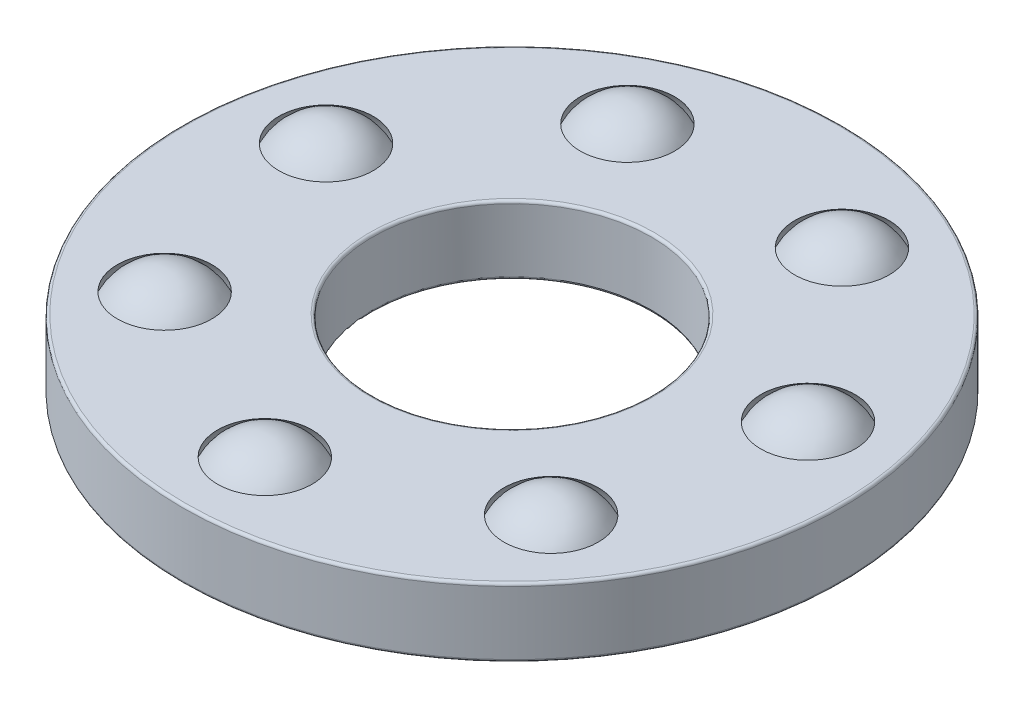
ISO-10303-21;
HEADER;
FILE_DESCRIPTION(('STEP AP214'),'2;1');
FILE_NAME('part.step','',(''),(''),'','','');
FILE_SCHEMA(('AUTOMOTIVE_DESIGN { 1 0 10303 214 1 1 1 1 }'));
ENDSEC;
DATA;
#1=APPLICATION_CONTEXT('core data for automotive mechanical design processes');
#2=APPLICATION_PROTOCOL_DEFINITION('international standard','automotive_design',2000,#1);
#3=PRODUCT_CONTEXT('',#1,'mechanical');
#4=PRODUCT('Part','Part','',(#3));
#5=PRODUCT_RELATED_PRODUCT_CATEGORY('part','',(#4));
#6=PRODUCT_DEFINITION_FORMATION('','',#4);
#7=PRODUCT_DEFINITION_CONTEXT('part definition',#1,'design');
#8=PRODUCT_DEFINITION('design','',#6,#7);
#9=PRODUCT_DEFINITION_SHAPE('','',#8);
#10=(LENGTH_UNIT() NAMED_UNIT(*) SI_UNIT(.MILLI.,.METRE.));
#11=(NAMED_UNIT(*) PLANE_ANGLE_UNIT() SI_UNIT($,.RADIAN.));
#12=(NAMED_UNIT(*) SI_UNIT($,.STERADIAN.) SOLID_ANGLE_UNIT());
#13=UNCERTAINTY_MEASURE_WITH_UNIT(LENGTH_MEASURE(1.E-05),#10,'distance_accuracy_value','');
#14=(GEOMETRIC_REPRESENTATION_CONTEXT(3) GLOBAL_UNCERTAINTY_ASSIGNED_CONTEXT((#13)) GLOBAL_UNIT_ASSIGNED_CONTEXT((#10,
#11,#12)) REPRESENTATION_CONTEXT('',''));
#15=CARTESIAN_POINT('',(0.,0.,0.));
#16=DIRECTION('',(0.,0.,1.));
#17=DIRECTION('',(1.,0.,0.));
#18=AXIS2_PLACEMENT_3D('',#15,#16,#17);
#19=CARTESIAN_POINT('',(-3.51824167110602,-1.11022302462516E-13,2.80570410836445));
#20=DIRECTION('',(0.,1.,0.));
#21=DIRECTION('',(0.781831482468023,0.,-0.623489801858743));
#22=AXIS2_PLACEMENT_3D('',#19,#20,#21);
#23=SPHERICAL_SURFACE('',#22,1.);
#24=CARTESIAN_POINT('',(-3.51824167110602,0.999999999999889,2.80570410836445));
#25=VERTEX_POINT('',#24);
#26=VERTEX_LOOP('',#25);
#27=FACE_BOUND('',#26,.T.);
#28=ADVANCED_FACE('F41',(#27),#23,.T.);
#29=CLOSED_SHELL('',(#28));
#30=MANIFOLD_SOLID_BREP('B2',#29);
#31=CARTESIAN_POINT('',(-4.38717560481816,-1.11022302462516E-13,-1.00134420280357));
#32=DIRECTION('',(0.,1.,0.));
#33=DIRECTION('',(0.974927912181827,0.,0.222520933956306));
#34=AXIS2_PLACEMENT_3D('',#31,#32,#33);
#35=SPHERICAL_SURFACE('',#34,1.);
#36=CARTESIAN_POINT('',(-4.38717560481816,0.999999999999889,-1.00134420280357));
#37=VERTEX_POINT('',#36);
#38=VERTEX_LOOP('',#37);
#39=FACE_BOUND('',#38,.T.);
#40=ADVANCED_FACE('F59',(#39),#35,.T.);
#41=CLOSED_SHELL('',(#40));
#42=MANIFOLD_SOLID_BREP('B6',#41);
#43=CARTESIAN_POINT('',(-1.95247682602906,-1.11022302462516E-13,-4.05435990556102));
#44=DIRECTION('',(0.,1.,0.));
#45=DIRECTION('',(0.433883739117565,0.,0.900968867902417));
#46=AXIS2_PLACEMENT_3D('',#43,#44,#45);
#47=SPHERICAL_SURFACE('',#46,1.);
#48=CARTESIAN_POINT('',(-1.95247682602906,0.999999999999889,-4.05435990556102));
#49=VERTEX_POINT('',#48);
#50=VERTEX_LOOP('',#49);
#51=FACE_BOUND('',#50,.T.);
#52=ADVANCED_FACE('F77',(#51),#47,.T.);
#53=CLOSED_SHELL('',(#52));
#54=MANIFOLD_SOLID_BREP('B37',#53);
#55=CARTESIAN_POINT('',(1.95247682602911,0.,-4.05435990556102));
#56=DIRECTION('',(0.,1.,0.));
#57=DIRECTION('',(-0.433883739117553,0.,0.900968867902423));
#58=AXIS2_PLACEMENT_3D('',#55,#56,#57);
#59=SPHERICAL_SURFACE('',#58,1.);
#60=CARTESIAN_POINT('',(1.95247682602911,1.,-4.05435990556102));
#61=VERTEX_POINT('',#60);
#62=VERTEX_LOOP('',#61);
#63=FACE_BOUND('',#62,.T.);
#64=ADVANCED_FACE('F95',(#63),#59,.T.);
#65=CLOSED_SHELL('',(#64));
#66=MANIFOLD_SOLID_BREP('B55',#65);
#67=CARTESIAN_POINT('',(4.38717560481824,0.,-1.00134420280368));
#68=DIRECTION('',(0.,1.,0.));
#69=DIRECTION('',(-0.974927912181824,0.,0.222520933956318));
#70=AXIS2_PLACEMENT_3D('',#67,#68,#69);
#71=SPHERICAL_SURFACE('',#70,1.);
#72=CARTESIAN_POINT('',(4.38717560481824,1.,-1.00134420280368));
#73=VERTEX_POINT('',#72);
#74=VERTEX_LOOP('',#73);
#75=FACE_BOUND('',#74,.T.);
#76=ADVANCED_FACE('F113',(#75),#71,.T.);
#77=CLOSED_SHELL('',(#76));
#78=MANIFOLD_SOLID_BREP('B73',#77);
#79=CARTESIAN_POINT('',(3.51824167110627,0.,2.80570410836367));
#80=DIRECTION('',(0.,1.,0.));
#81=DIRECTION('',(-0.781831482468032,0.,-0.623489801858733));
#82=AXIS2_PLACEMENT_3D('',#79,#80,#81);
#83=SPHERICAL_SURFACE('',#82,1.);
#84=CARTESIAN_POINT('',(3.51824167110627,1.,2.80570410836367));
#85=VERTEX_POINT('',#84);
#86=VERTEX_LOOP('',#85);
#87=FACE_BOUND('',#86,.T.);
#88=ADVANCED_FACE('F131',(#87),#83,.T.);
#89=CLOSED_SHELL('',(#88));
#90=MANIFOLD_SOLID_BREP('B91',#89);
#91=CARTESIAN_POINT('',(0.,0.,4.49999999999939));
#92=DIRECTION('',(0.,1.,0.));
#93=DIRECTION('',(0.,0.,-1.));
#94=AXIS2_PLACEMENT_3D('',#91,#92,#93);
#95=SPHERICAL_SURFACE('',#94,1.);
#96=CARTESIAN_POINT('',(0.,1.,4.49999999999939));
#97=VERTEX_POINT('',#96);
#98=VERTEX_LOOP('',#97);
#99=FACE_BOUND('',#98,.T.);
#100=ADVANCED_FACE('F150',(#99),#95,.T.);
#101=CLOSED_SHELL('',(#100));
#102=MANIFOLD_SOLID_BREP('B109',#101);
#103=CARTESIAN_POINT('',(0.,-2.46000000000002,0.));
#104=DIRECTION('',(0.,-1.,0.));
#105=DIRECTION('',(0.,0.,-1.));
#106=AXIS2_PLACEMENT_3D('',#103,#104,#105);
#107=CYLINDRICAL_SURFACE('',#106,6.);
#108=CARTESIAN_POINT('',(0.,-0.575800000000015,0.));
#109=DIRECTION('',(0.,1.,0.));
#110=DIRECTION('',(0.,0.,1.));
#111=AXIS2_PLACEMENT_3D('',#108,#109,#110);
#112=CIRCLE('',#111,6.);
#113=CARTESIAN_POINT('',(0.,-0.575800000000015,6.00000000000001));
#114=VERTEX_POINT('',#113);
#115=EDGE_CURVE('E149',#114,#114,#112,.T.);
#116=ORIENTED_EDGE('',*,*,#115,.T.);
#117=EDGE_LOOP('',(#116));
#118=FACE_BOUND('',#117,.T.);
#119=CARTESIAN_POINT('',(0.,0.575800000000015,-1.11022302462516E-13));
#120=DIRECTION('',(0.,-1.,0.));
#121=DIRECTION('',(0.,0.,-1.));
#122=AXIS2_PLACEMENT_3D('',#119,#120,#121);
#123=CIRCLE('',#122,6.);
#124=CARTESIAN_POINT('',(0.,0.575800000000015,-6.00000000000012));
#125=VERTEX_POINT('',#124);
#126=EDGE_CURVE('E169',#125,#125,#123,.T.);
#127=ORIENTED_EDGE('',*,*,#126,.T.);
#128=EDGE_LOOP('',(#127));
#129=FACE_BOUND('',#128,.T.);
#130=ADVANCED_FACE('F162',(#118,#129),#107,.T.);
#131=CARTESIAN_POINT('',(1.66533453693773E-13,-0.625000000000098,6.00000000000012));
#132=DIRECTION('',(0.,1.,0.));
#133=DIRECTION('',(0.,0.,1.));
#134=AXIS2_PLACEMENT_3D('',#131,#132,#133);
#135=PLANE('',#134);
#136=CARTESIAN_POINT('',(0.,-0.624999999999987,0.));
#137=DIRECTION('',(0.,1.,0.));
#138=DIRECTION('',(0.,0.,1.));
#139=AXIS2_PLACEMENT_3D('',#136,#137,#138);
#140=CIRCLE('',#139,2.5872);
#141=CARTESIAN_POINT('',(0.,-0.624999999999987,2.5872));
#142=VERTEX_POINT('',#141);
#143=EDGE_CURVE('E182',#142,#142,#140,.T.);
#144=ORIENTED_EDGE('',*,*,#143,.T.);
#145=EDGE_LOOP('',(#144));
#146=FACE_BOUND('',#145,.T.);
#147=CARTESIAN_POINT('',(0.,-0.624999999999987,0.));
#148=DIRECTION('',(0.,1.,0.));
#149=DIRECTION('',(0.,0.,1.));
#150=AXIS2_PLACEMENT_3D('',#147,#148,#149);
#151=CIRCLE('',#150,5.9508);
#152=CARTESIAN_POINT('',(0.,-0.624999999999987,5.95080000000001));
#153=VERTEX_POINT('',#152);
#154=EDGE_CURVE('E185',#153,#153,#151,.F.);
#155=ORIENTED_EDGE('',*,*,#154,.T.);
#156=EDGE_LOOP('',(#155));
#157=FACE_BOUND('',#156,.T.);
#158=CARTESIAN_POINT('',(-3.51824167110604,-0.625000000000098,2.80570410836445));
#159=DIRECTION('',(0.,1.,0.));
#160=DIRECTION('',(-0.781831482468023,0.,0.623489801858743));
#161=AXIS2_PLACEMENT_3D('',#158,#159,#160);
#162=CIRCLE('',#161,0.85923294280422);
#163=CARTESIAN_POINT('',(-4.19001703656402,-0.625000000000098,3.34142708562396));
#164=VERTEX_POINT('',#163);
#165=EDGE_CURVE('E230',#164,#164,#162,.T.);
#166=ORIENTED_EDGE('',*,*,#165,.T.);
#167=EDGE_LOOP('',(#166));
#168=FACE_BOUND('',#167,.T.);
#169=CARTESIAN_POINT('',(-4.38717560481813,-0.625000000000098,-1.00134420280362));
#170=DIRECTION('',(0.,1.,0.));
#171=DIRECTION('',(-0.974927912181827,0.,-0.222520933956305));
#172=AXIS2_PLACEMENT_3D('',#169,#170,#171);
#173=CIRCLE('',#172,0.85923294280422);
#174=CARTESIAN_POINT('',(-5.2248657838241,-0.625000000000098,-1.19254151972244));
#175=VERTEX_POINT('',#174);
#176=EDGE_CURVE('E224',#175,#175,#173,.T.);
#177=ORIENTED_EDGE('',*,*,#176,.T.);
#178=EDGE_LOOP('',(#177));
#179=FACE_BOUND('',#178,.T.);
#180=CARTESIAN_POINT('',(-1.95247682602903,-0.625000000000098,-4.05435990556102));
#181=DIRECTION('',(0.,1.,0.));
#182=DIRECTION('',(-0.433883739117566,0.,-0.900968867902417));
#183=AXIS2_PLACEMENT_3D('',#180,#181,#182);
#184=CIRCLE('',#183,0.85923294280422);
#185=CARTESIAN_POINT('',(-2.32528402802592,-0.625000000000098,-4.8285020373038));
#186=VERTEX_POINT('',#185);
#187=EDGE_CURVE('E218',#186,#186,#184,.T.);
#188=ORIENTED_EDGE('',*,*,#187,.T.);
#189=EDGE_LOOP('',(#188));
#190=FACE_BOUND('',#189,.T.);
#191=CARTESIAN_POINT('',(1.95247682602902,-0.624999999999987,-4.05435990556102));
#192=DIRECTION('',(0.,1.,0.));
#193=DIRECTION('',(0.433883739117553,0.,-0.900968867902423));
#194=AXIS2_PLACEMENT_3D('',#191,#192,#193);
#195=CIRCLE('',#194,0.85923294280422);
#196=CARTESIAN_POINT('',(2.32528402802589,-0.624999999999987,-4.82850203730381));
#197=VERTEX_POINT('',#196);
#198=EDGE_CURVE('E212',#197,#197,#195,.T.);
#199=ORIENTED_EDGE('',*,*,#198,.T.);
#200=EDGE_LOOP('',(#199));
#201=FACE_BOUND('',#200,.T.);
#202=CARTESIAN_POINT('',(4.3871756048182,-0.624999999999987,-1.00134420280373));
#203=DIRECTION('',(0.,1.,0.));
#204=DIRECTION('',(0.974927912181825,0.,-0.222520933956319));
#205=AXIS2_PLACEMENT_3D('',#202,#203,#204);
#206=CIRCLE('',#205,0.85923294280422);
#207=CARTESIAN_POINT('',(5.22486578382417,-0.624999999999987,-1.19254151972256));
#208=VERTEX_POINT('',#207);
#209=EDGE_CURVE('E206',#208,#208,#206,.T.);
#210=ORIENTED_EDGE('',*,*,#209,.T.);
#211=EDGE_LOOP('',(#210));
#212=FACE_BOUND('',#211,.T.);
#213=CARTESIAN_POINT('',(3.51824167110627,-0.624999999999987,2.80570410836367));
#214=DIRECTION('',(0.,1.,0.));
#215=DIRECTION('',(0.781831482468032,0.,0.623489801858733));
#216=AXIS2_PLACEMENT_3D('',#213,#214,#215);
#217=CIRCLE('',#216,0.85923294280422);
#218=CARTESIAN_POINT('',(4.19001703656427,-0.624999999999987,3.34142708562317));
#219=VERTEX_POINT('',#218);
#220=EDGE_CURVE('E198',#219,#219,#217,.T.);
#221=ORIENTED_EDGE('',*,*,#220,.T.);
#222=EDGE_LOOP('',(#221));
#223=FACE_BOUND('',#222,.T.);
#224=CARTESIAN_POINT('',(0.,-0.624999999999987,4.4999999999995));
#225=DIRECTION('',(0.,1.,0.));
#226=DIRECTION('',(0.,0.,1.));
#227=AXIS2_PLACEMENT_3D('',#224,#225,#226);
#228=CIRCLE('',#227,0.85923294280422);
#229=CARTESIAN_POINT('',(0.,-0.624999999999987,5.35923294280373));
#230=VERTEX_POINT('',#229);
#231=EDGE_CURVE('E194',#230,#230,#228,.T.);
#232=ORIENTED_EDGE('',*,*,#231,.T.);
#233=EDGE_LOOP('',(#232));
#234=FACE_BOUND('',#233,.T.);
#235=ADVANCED_FACE('F248',(#146,#157,#168,#179,#190,#201,#212,#223,#234),#135,.F.);
#236=CARTESIAN_POINT('',(0.,-2.46000000000002,0.));
#237=DIRECTION('',(0.,-1.,0.));
#238=DIRECTION('',(0.,0.,-1.));
#239=AXIS2_PLACEMENT_3D('',#236,#237,#238);
#240=CYLINDRICAL_SURFACE('',#239,2.538);
#241=CARTESIAN_POINT('',(0.,-0.575800000000015,0.));
#242=DIRECTION('',(0.,1.,0.));
#243=DIRECTION('',(0.,0.,1.));
#244=AXIS2_PLACEMENT_3D('',#241,#242,#243);
#245=CIRCLE('',#244,2.538);
#246=CARTESIAN_POINT('',(0.,-0.575800000000015,2.538));
#247=VERTEX_POINT('',#246);
#248=EDGE_CURVE('E188',#247,#247,#245,.F.);
#249=ORIENTED_EDGE('',*,*,#248,.T.);
#250=EDGE_LOOP('',(#249));
#251=FACE_BOUND('',#250,.T.);
#252=CARTESIAN_POINT('',(0.,0.575800000000015,-1.11022302462516E-13));
#253=DIRECTION('',(0.,-1.,0.));
#254=DIRECTION('',(0.,0.,-1.));
#255=AXIS2_PLACEMENT_3D('',#252,#253,#254);
#256=CIRCLE('',#255,2.538);
#257=CARTESIAN_POINT('',(0.,0.575800000000015,-2.53800000000011));
#258=VERTEX_POINT('',#257);
#259=EDGE_CURVE('E191',#258,#258,#256,.F.);
#260=ORIENTED_EDGE('',*,*,#259,.T.);
#261=EDGE_LOOP('',(#260));
#262=FACE_BOUND('',#261,.T.);
#263=ADVANCED_FACE('F251',(#251,#262),#240,.F.);
#264=CARTESIAN_POINT('',(1.11022302462516E-13,0.624999999999876,6.00000000000012));
#265=DIRECTION('',(0.,-1.,0.));
#266=DIRECTION('',(0.,0.,-1.));
#267=AXIS2_PLACEMENT_3D('',#264,#265,#266);
#268=PLANE('',#267);
#269=CARTESIAN_POINT('',(0.,0.624999999999987,-1.11022302462516E-13));
#270=DIRECTION('',(0.,-1.,0.));
#271=DIRECTION('',(0.,0.,-1.));
#272=AXIS2_PLACEMENT_3D('',#269,#270,#271);
#273=CIRCLE('',#272,2.5872);
#274=CARTESIAN_POINT('',(0.,0.624999999999987,-2.58720000000011));
#275=VERTEX_POINT('',#274);
#276=EDGE_CURVE('E173',#275,#275,#273,.T.);
#277=ORIENTED_EDGE('',*,*,#276,.T.);
#278=EDGE_LOOP('',(#277));
#279=FACE_BOUND('',#278,.T.);
#280=CARTESIAN_POINT('',(0.,0.624999999999987,-1.11022302462516E-13));
#281=DIRECTION('',(0.,-1.,0.));
#282=DIRECTION('',(0.,0.,-1.));
#283=AXIS2_PLACEMENT_3D('',#280,#281,#282);
#284=CIRCLE('',#283,5.9508);
#285=CARTESIAN_POINT('',(0.,0.624999999999987,-5.95080000000012));
#286=VERTEX_POINT('',#285);
#287=EDGE_CURVE('E177',#286,#286,#284,.F.);
#288=ORIENTED_EDGE('',*,*,#287,.T.);
#289=EDGE_LOOP('',(#288));
#290=FACE_BOUND('',#289,.T.);
#291=CARTESIAN_POINT('',(-3.51824167110609,0.624999999999876,2.80570410836445));
#292=DIRECTION('',(0.,-1.,0.));
#293=DIRECTION('',(0.781831482468023,0.,-0.623489801858743));
#294=AXIS2_PLACEMENT_3D('',#291,#292,#293);
#295=CIRCLE('',#294,0.85923294280422);
#296=CARTESIAN_POINT('',(-2.84646630564811,0.624999999999876,2.26998113110494));
#297=VERTEX_POINT('',#296);
#298=EDGE_CURVE('E233',#297,#297,#295,.T.);
#299=ORIENTED_EDGE('',*,*,#298,.T.);
#300=EDGE_LOOP('',(#299));
#301=FACE_BOUND('',#300,.T.);
#302=CARTESIAN_POINT('',(-4.38717560481824,0.624999999999876,-1.00134420280351));
#303=DIRECTION('',(0.,-1.,0.));
#304=DIRECTION('',(0.974927912181827,0.,0.222520933956305));
#305=AXIS2_PLACEMENT_3D('',#302,#303,#304);
#306=CIRCLE('',#305,0.85923294280422);
#307=CARTESIAN_POINT('',(-3.54948542581228,0.624999999999876,-0.810146885884692));
#308=VERTEX_POINT('',#307);
#309=EDGE_CURVE('E227',#308,#308,#306,.T.);
#310=ORIENTED_EDGE('',*,*,#309,.T.);
#311=EDGE_LOOP('',(#310));
#312=FACE_BOUND('',#311,.T.);
#313=CARTESIAN_POINT('',(-1.95247682602909,0.624999999999876,-4.05435990556102));
#314=DIRECTION('',(0.,-1.,0.));
#315=DIRECTION('',(0.433883739117566,0.,0.900968867902417));
#316=AXIS2_PLACEMENT_3D('',#313,#314,#315);
#317=CIRCLE('',#316,0.85923294280422);
#318=CARTESIAN_POINT('',(-1.5796696240322,0.624999999999876,-3.28021777381824));
#319=VERTEX_POINT('',#318);
#320=EDGE_CURVE('E221',#319,#319,#317,.T.);
#321=ORIENTED_EDGE('',*,*,#320,.T.);
#322=EDGE_LOOP('',(#321));
#323=FACE_BOUND('',#322,.T.);
#324=CARTESIAN_POINT('',(1.95247682602895,0.624999999999987,-4.05435990556091));
#325=DIRECTION('',(0.,-1.,0.));
#326=DIRECTION('',(-0.433883739117553,0.,0.900968867902423));
#327=AXIS2_PLACEMENT_3D('',#324,#325,#326);
#328=CIRCLE('',#327,0.85923294280422);
#329=CARTESIAN_POINT('',(1.57966962403207,0.624999999999987,-3.28021777381813));
#330=VERTEX_POINT('',#329);
#331=EDGE_CURVE('E215',#330,#330,#328,.T.);
#332=ORIENTED_EDGE('',*,*,#331,.T.);
#333=EDGE_LOOP('',(#332));
#334=FACE_BOUND('',#333,.T.);
#335=CARTESIAN_POINT('',(4.38717560481824,0.624999999999987,-1.00134420280373));
#336=DIRECTION('',(0.,-1.,0.));
#337=DIRECTION('',(-0.974927912181825,0.,0.222520933956319));
#338=AXIS2_PLACEMENT_3D('',#335,#336,#337);
#339=CIRCLE('',#338,0.85923294280422);
#340=CARTESIAN_POINT('',(3.54948542581228,0.624999999999987,-0.810146885884902));
#341=VERTEX_POINT('',#340);
#342=EDGE_CURVE('E209',#341,#341,#339,.T.);
#343=ORIENTED_EDGE('',*,*,#342,.T.);
#344=EDGE_LOOP('',(#343));
#345=FACE_BOUND('',#344,.T.);
#346=CARTESIAN_POINT('',(3.51824167110622,0.624999999999987,2.80570410836367));
#347=DIRECTION('',(0.,-1.,0.));
#348=DIRECTION('',(-0.781831482468032,0.,-0.623489801858733));
#349=AXIS2_PLACEMENT_3D('',#346,#347,#348);
#350=CIRCLE('',#349,0.85923294280422);
#351=CARTESIAN_POINT('',(2.84646630564822,0.624999999999987,2.26998113110417));
#352=VERTEX_POINT('',#351);
#353=EDGE_CURVE('E203',#352,#352,#350,.T.);
#354=ORIENTED_EDGE('',*,*,#353,.T.);
#355=EDGE_LOOP('',(#354));
#356=FACE_BOUND('',#355,.T.);
#357=CARTESIAN_POINT('',(0.,0.624999999999987,4.4999999999995));
#358=DIRECTION('',(0.,-1.,0.));
#359=DIRECTION('',(0.,0.,-1.));
#360=AXIS2_PLACEMENT_3D('',#357,#358,#359);
#361=CIRCLE('',#360,0.85923294280422);
#362=CARTESIAN_POINT('',(0.,0.624999999999987,3.64076705719528));
#363=VERTEX_POINT('',#362);
#364=EDGE_CURVE('E195',#363,#363,#361,.T.);
#365=ORIENTED_EDGE('',*,*,#364,.T.);
#366=EDGE_LOOP('',(#365));
#367=FACE_BOUND('',#366,.T.);
#368=ADVANCED_FACE('F237',(#279,#290,#301,#312,#323,#334,#345,#356,#367),#268,.F.);
#369=CARTESIAN_POINT('',(0.,0.,4.49999999999939));
#370=DIRECTION('',(0.,1.,0.));
#371=DIRECTION('',(0.,0.,-1.));
#372=AXIS2_PLACEMENT_3D('',#369,#370,#371);
#373=SPHERICAL_SURFACE('',#372,1.0625);
#374=ORIENTED_EDGE('',*,*,#364,.F.);
#375=EDGE_LOOP('',(#374));
#376=FACE_BOUND('',#375,.T.);
#377=ORIENTED_EDGE('',*,*,#231,.F.);
#378=EDGE_LOOP('',(#377));
#379=FACE_BOUND('',#378,.T.);
#380=ADVANCED_FACE('F266',(#376,#379),#373,.F.);
#381=CARTESIAN_POINT('',(3.51824167110627,0.,2.80570410836367));
#382=DIRECTION('',(0.,1.,0.));
#383=DIRECTION('',(-0.781831482468032,0.,-0.623489801858733));
#384=AXIS2_PLACEMENT_3D('',#381,#382,#383);
#385=SPHERICAL_SURFACE('',#384,1.0625);
#386=ORIENTED_EDGE('',*,*,#353,.F.);
#387=EDGE_LOOP('',(#386));
#388=FACE_BOUND('',#387,.T.);
#389=ORIENTED_EDGE('',*,*,#220,.F.);
#390=EDGE_LOOP('',(#389));
#391=FACE_BOUND('',#390,.T.);
#392=ADVANCED_FACE('F268',(#388,#391),#385,.F.);
#393=CARTESIAN_POINT('',(4.3871756048183,0.,-1.00134420280362));
#394=DIRECTION('',(0.,1.,0.));
#395=DIRECTION('',(-0.974927912181825,0.,0.222520933956319));
#396=AXIS2_PLACEMENT_3D('',#393,#394,#395);
#397=SPHERICAL_SURFACE('',#396,1.0625);
#398=ORIENTED_EDGE('',*,*,#342,.F.);
#399=EDGE_LOOP('',(#398));
#400=FACE_BOUND('',#399,.T.);
#401=ORIENTED_EDGE('',*,*,#209,.F.);
#402=EDGE_LOOP('',(#401));
#403=FACE_BOUND('',#402,.T.);
#404=ADVANCED_FACE('F275',(#400,#403),#397,.F.);
#405=CARTESIAN_POINT('',(1.95247682602907,0.,-4.05435990556113));
#406=DIRECTION('',(0.,1.,0.));
#407=DIRECTION('',(-0.433883739117553,0.,0.900968867902423));
#408=AXIS2_PLACEMENT_3D('',#405,#406,#407);
#409=SPHERICAL_SURFACE('',#408,1.0625);
#410=ORIENTED_EDGE('',*,*,#331,.F.);
#411=EDGE_LOOP('',(#410));
#412=FACE_BOUND('',#411,.T.);
#413=ORIENTED_EDGE('',*,*,#198,.F.);
#414=EDGE_LOOP('',(#413));
#415=FACE_BOUND('',#414,.T.);
#416=ADVANCED_FACE('F349',(#412,#415),#409,.F.);
#417=CARTESIAN_POINT('',(-1.95247682602903,-1.11022302462516E-13,-4.05435990556102));
#418=DIRECTION('',(0.,1.,0.));
#419=DIRECTION('',(0.433883739117566,0.,0.900968867902417));
#420=AXIS2_PLACEMENT_3D('',#417,#418,#419);
#421=SPHERICAL_SURFACE('',#420,1.0625);
#422=ORIENTED_EDGE('',*,*,#320,.F.);
#423=EDGE_LOOP('',(#422));
#424=FACE_BOUND('',#423,.T.);
#425=ORIENTED_EDGE('',*,*,#187,.F.);
#426=EDGE_LOOP('',(#425));
#427=FACE_BOUND('',#426,.T.);
#428=ADVANCED_FACE('F339',(#424,#427),#421,.F.);
#429=CARTESIAN_POINT('',(-4.38717560481813,-1.11022302462516E-13,-1.00134420280362));
#430=DIRECTION('',(0.,1.,0.));
#431=DIRECTION('',(0.974927912181827,0.,0.222520933956305));
#432=AXIS2_PLACEMENT_3D('',#429,#430,#431);
#433=SPHERICAL_SURFACE('',#432,1.0625);
#434=ORIENTED_EDGE('',*,*,#309,.F.);
#435=EDGE_LOOP('',(#434));
#436=FACE_BOUND('',#435,.T.);
#437=ORIENTED_EDGE('',*,*,#176,.F.);
#438=EDGE_LOOP('',(#437));
#439=FACE_BOUND('',#438,.T.);
#440=ADVANCED_FACE('F244',(#436,#439),#433,.F.);
#441=CARTESIAN_POINT('',(-3.51824167110604,-1.11022302462516E-13,2.80570410836445));
#442=DIRECTION('',(0.,1.,0.));
#443=DIRECTION('',(0.781831482468023,0.,-0.623489801858743));
#444=AXIS2_PLACEMENT_3D('',#441,#442,#443);
#445=SPHERICAL_SURFACE('',#444,1.0625);
#446=ORIENTED_EDGE('',*,*,#298,.F.);
#447=EDGE_LOOP('',(#446));
#448=FACE_BOUND('',#447,.T.);
#449=ORIENTED_EDGE('',*,*,#165,.F.);
#450=EDGE_LOOP('',(#449));
#451=FACE_BOUND('',#450,.T.);
#452=ADVANCED_FACE('F240',(#448,#451),#445,.F.);
#453=CARTESIAN_POINT('',(0.,-0.575800000000015,0.));
#454=DIRECTION('',(0.,1.,0.));
#455=DIRECTION('',(0.,0.,1.));
#456=AXIS2_PLACEMENT_3D('',#453,#454,#455);
#457=TOROIDAL_SURFACE('',#456,2.5872,0.0492);
#458=ORIENTED_EDGE('',*,*,#143,.F.);
#459=EDGE_LOOP('',(#458));
#460=FACE_BOUND('',#459,.T.);
#461=ORIENTED_EDGE('',*,*,#248,.F.);
#462=EDGE_LOOP('',(#461));
#463=FACE_BOUND('',#462,.T.);
#464=ADVANCED_FACE('F243',(#460,#463),#457,.T.);
#465=CARTESIAN_POINT('',(0.,0.575800000000015,-1.11022302462516E-13));
#466=DIRECTION('',(0.,-1.,0.));
#467=DIRECTION('',(0.,0.,-1.));
#468=AXIS2_PLACEMENT_3D('',#465,#466,#467);
#469=TOROIDAL_SURFACE('',#468,2.5872,0.0492);
#470=ORIENTED_EDGE('',*,*,#259,.F.);
#471=EDGE_LOOP('',(#470));
#472=FACE_BOUND('',#471,.T.);
#473=ORIENTED_EDGE('',*,*,#276,.F.);
#474=EDGE_LOOP('',(#473));
#475=FACE_BOUND('',#474,.T.);
#476=ADVANCED_FACE('F289',(#472,#475),#469,.T.);
#477=CARTESIAN_POINT('',(0.,-0.575800000000015,0.));
#478=DIRECTION('',(0.,1.,0.));
#479=DIRECTION('',(0.,0.,1.));
#480=AXIS2_PLACEMENT_3D('',#477,#478,#479);
#481=TOROIDAL_SURFACE('',#480,5.9508,0.0492);
#482=ORIENTED_EDGE('',*,*,#115,.F.);
#483=EDGE_LOOP('',(#482));
#484=FACE_BOUND('',#483,.T.);
#485=ORIENTED_EDGE('',*,*,#154,.F.);
#486=EDGE_LOOP('',(#485));
#487=FACE_BOUND('',#486,.T.);
#488=ADVANCED_FACE('F292',(#484,#487),#481,.T.);
#489=CARTESIAN_POINT('',(0.,0.575800000000015,-1.11022302462516E-13));
#490=DIRECTION('',(0.,-1.,0.));
#491=DIRECTION('',(0.,0.,-1.));
#492=AXIS2_PLACEMENT_3D('',#489,#490,#491);
#493=TOROIDAL_SURFACE('',#492,5.9508,0.0492);
#494=ORIENTED_EDGE('',*,*,#287,.F.);
#495=EDGE_LOOP('',(#494));
#496=FACE_BOUND('',#495,.T.);
#497=ORIENTED_EDGE('',*,*,#126,.F.);
#498=EDGE_LOOP('',(#497));
#499=FACE_BOUND('',#498,.T.);
#500=ADVANCED_FACE('F164',(#496,#499),#493,.T.);
#501=CLOSED_SHELL('',(#130,#235,#263,#368,#380,#392,#404,#416,#428,#440,#452,#464,#476,#488,#500));
#502=MANIFOLD_SOLID_BREP('B127',#501);
#503=ADVANCED_BREP_SHAPE_REPRESENTATION('',(#18,#30,#42,#54,#66,#78,#90,#102,#502),#14);
#504=SHAPE_DEFINITION_REPRESENTATION(#9,#503);
ENDSEC;
END-ISO-10303-21;
